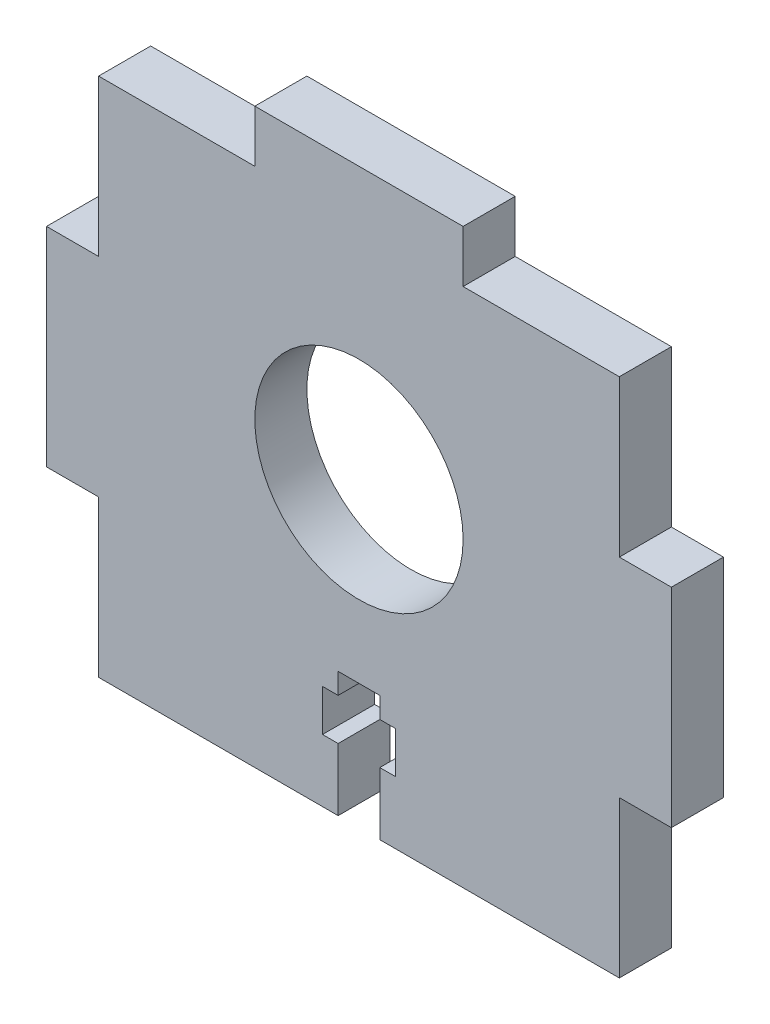
ISO-10303-21;
HEADER;
FILE_DESCRIPTION(('STEP AP214'),'2;1');
FILE_NAME('part.step','',(''),(''),'','','');
FILE_SCHEMA(('AUTOMOTIVE_DESIGN { 1 0 10303 214 1 1 1 1 }'));
ENDSEC;
DATA;
#1=APPLICATION_CONTEXT('core data for automotive mechanical design processes');
#2=APPLICATION_PROTOCOL_DEFINITION('international standard','automotive_design',2000,#1);
#3=PRODUCT_CONTEXT('',#1,'mechanical');
#4=PRODUCT('Part','Part','',(#3));
#5=PRODUCT_RELATED_PRODUCT_CATEGORY('part','',(#4));
#6=PRODUCT_DEFINITION_FORMATION('','',#4);
#7=PRODUCT_DEFINITION_CONTEXT('part definition',#1,'design');
#8=PRODUCT_DEFINITION('design','',#6,#7);
#9=PRODUCT_DEFINITION_SHAPE('','',#8);
#10=(LENGTH_UNIT() NAMED_UNIT(*) SI_UNIT(.MILLI.,.METRE.));
#11=(NAMED_UNIT(*) PLANE_ANGLE_UNIT() SI_UNIT($,.RADIAN.));
#12=(NAMED_UNIT(*) SI_UNIT($,.STERADIAN.) SOLID_ANGLE_UNIT());
#13=UNCERTAINTY_MEASURE_WITH_UNIT(LENGTH_MEASURE(1.E-05),#10,'distance_accuracy_value','');
#14=(GEOMETRIC_REPRESENTATION_CONTEXT(3) GLOBAL_UNCERTAINTY_ASSIGNED_CONTEXT((#13)) GLOBAL_UNIT_ASSIGNED_CONTEXT((#10,
#11,#12)) REPRESENTATION_CONTEXT('',''));
#15=CARTESIAN_POINT('',(0.,0.,0.));
#16=DIRECTION('',(0.,0.,1.));
#17=DIRECTION('',(1.,0.,0.));
#18=AXIS2_PLACEMENT_3D('',#15,#16,#17);
#19=CARTESIAN_POINT('',(-26.7512574518603,-20.1299853784487,5.));
#20=DIRECTION('',(0.,1.,0.));
#21=DIRECTION('',(0.,0.,1.));
#22=AXIS2_PLACEMENT_3D('',#19,#20,#21);
#23=PLANE('',#22);
#24=DIRECTION('',(1.,0.,0.));
#25=VECTOR('',#24,1.);
#26=CARTESIAN_POINT('',(-26.7512574518603,-20.1299853784487,0.));
#27=LINE('',#26,#25);
#28=CARTESIAN_POINT('',(-26.7512574518603,-20.1299853784487,0.));
#29=VERTEX_POINT('',#28);
#30=CARTESIAN_POINT('',(-3.75125745186031,-20.1299853784487,0.));
#31=VERTEX_POINT('',#30);
#32=EDGE_CURVE('E228',#29,#31,#27,.T.);
#33=ORIENTED_EDGE('',*,*,#32,.T.);
#34=DIRECTION('',(0.,0.,1.));
#35=VECTOR('',#34,1.);
#36=CARTESIAN_POINT('',(-3.75125745186031,-20.1299853784487,0.));
#37=LINE('',#36,#35);
#38=CARTESIAN_POINT('',(-3.75125745186031,-20.1299853784487,5.));
#39=VERTEX_POINT('',#38);
#40=EDGE_CURVE('E321',#31,#39,#37,.T.);
#41=ORIENTED_EDGE('',*,*,#40,.T.);
#42=DIRECTION('',(1.,0.,0.));
#43=VECTOR('',#42,1.);
#44=CARTESIAN_POINT('',(-26.7512574518603,-20.1299853784487,5.));
#45=LINE('',#44,#43);
#46=CARTESIAN_POINT('',(-26.7512574518603,-20.1299853784487,5.));
#47=VERTEX_POINT('',#46);
#48=EDGE_CURVE('E192',#47,#39,#45,.T.);
#49=ORIENTED_EDGE('',*,*,#48,.F.);
#50=DIRECTION('',(0.,0.,-1.));
#51=VECTOR('',#50,1.);
#52=CARTESIAN_POINT('',(-26.7512574518603,-20.1299853784487,5.));
#53=LINE('',#52,#51);
#54=EDGE_CURVE('E186',#47,#29,#53,.T.);
#55=ORIENTED_EDGE('',*,*,#54,.T.);
#56=EDGE_LOOP('',(#33,#41,#49,#55));
#57=FACE_BOUND('',#56,.T.);
#58=ADVANCED_FACE('F33',(#57),#23,.F.);
#59=CARTESIAN_POINT('',(23.2487425481397,-5.1299853784487,5.));
#60=DIRECTION('',(-1.,0.,0.));
#61=DIRECTION('',(0.,0.,1.));
#62=AXIS2_PLACEMENT_3D('',#59,#60,#61);
#63=PLANE('',#62);
#64=DIRECTION('',(0.,1.,0.));
#65=VECTOR('',#64,1.);
#66=CARTESIAN_POINT('',(23.2487425481397,-5.1299853784487,0.));
#67=LINE('',#66,#65);
#68=CARTESIAN_POINT('',(23.2487425481397,-20.1299853784487,0.));
#69=VERTEX_POINT('',#68);
#70=CARTESIAN_POINT('',(23.2487425481397,-5.1299853784487,0.));
#71=VERTEX_POINT('',#70);
#72=EDGE_CURVE('E197',#69,#71,#67,.T.);
#73=ORIENTED_EDGE('',*,*,#72,.T.);
#74=DIRECTION('',(0.,0.,-1.));
#75=VECTOR('',#74,1.);
#76=CARTESIAN_POINT('',(23.2487425481397,-5.1299853784487,5.));
#77=LINE('',#76,#75);
#78=CARTESIAN_POINT('',(23.2487425481397,-5.1299853784487,5.));
#79=VERTEX_POINT('',#78);
#80=EDGE_CURVE('E11',#79,#71,#77,.T.);
#81=ORIENTED_EDGE('',*,*,#80,.F.);
#82=DIRECTION('',(0.,1.,0.));
#83=VECTOR('',#82,1.);
#84=CARTESIAN_POINT('',(23.2487425481397,-5.1299853784487,5.));
#85=LINE('',#84,#83);
#86=CARTESIAN_POINT('',(23.2487425481397,-20.1299853784487,5.));
#87=VERTEX_POINT('',#86);
#88=EDGE_CURVE('E231',#87,#79,#85,.T.);
#89=ORIENTED_EDGE('',*,*,#88,.F.);
#90=DIRECTION('',(0.,0.,-1.));
#91=VECTOR('',#90,1.);
#92=CARTESIAN_POINT('',(23.2487425481397,-20.1299853784487,5.));
#93=LINE('',#92,#91);
#94=EDGE_CURVE('E196',#87,#69,#93,.T.);
#95=ORIENTED_EDGE('',*,*,#94,.T.);
#96=EDGE_LOOP('',(#73,#81,#89,#95));
#97=FACE_BOUND('',#96,.T.);
#98=ADVANCED_FACE('F35',(#97),#63,.F.);
#99=CARTESIAN_POINT('',(23.2487425481397,-5.1299853784487,5.));
#100=DIRECTION('',(0.,1.,0.));
#101=DIRECTION('',(-1.,0.,0.));
#102=AXIS2_PLACEMENT_3D('',#99,#100,#101);
#103=PLANE('',#102);
#104=DIRECTION('',(1.,0.,0.));
#105=VECTOR('',#104,1.);
#106=CARTESIAN_POINT('',(23.2487425481397,-5.1299853784487,0.));
#107=LINE('',#106,#105);
#108=CARTESIAN_POINT('',(28.2487425481397,-5.12998537844871,0.));
#109=VERTEX_POINT('',#108);
#110=EDGE_CURVE('E200',#71,#109,#107,.T.);
#111=ORIENTED_EDGE('',*,*,#110,.T.);
#112=DIRECTION('',(0.,0.,-1.));
#113=VECTOR('',#112,1.);
#114=CARTESIAN_POINT('',(28.2487425481397,-5.12998537844871,5.));
#115=LINE('',#114,#113);
#116=CARTESIAN_POINT('',(28.2487425481397,-5.12998537844871,5.));
#117=VERTEX_POINT('',#116);
#118=EDGE_CURVE('E41',#117,#109,#115,.T.);
#119=ORIENTED_EDGE('',*,*,#118,.F.);
#120=DIRECTION('',(1.,0.,0.));
#121=VECTOR('',#120,1.);
#122=CARTESIAN_POINT('',(23.2487425481397,-5.1299853784487,5.));
#123=LINE('',#122,#121);
#124=EDGE_CURVE('E123',#79,#117,#123,.T.);
#125=ORIENTED_EDGE('',*,*,#124,.F.);
#126=ORIENTED_EDGE('',*,*,#80,.T.);
#127=EDGE_LOOP('',(#111,#119,#125,#126));
#128=FACE_BOUND('',#127,.T.);
#129=ADVANCED_FACE('F488',(#128),#103,.F.);
#130=CARTESIAN_POINT('',(28.2487425481397,14.8700146215513,5.));
#131=DIRECTION('',(-1.,0.,0.));
#132=DIRECTION('',(0.,-1.,0.));
#133=AXIS2_PLACEMENT_3D('',#130,#131,#132);
#134=PLANE('',#133);
#135=DIRECTION('',(0.,1.,0.));
#136=VECTOR('',#135,1.);
#137=CARTESIAN_POINT('',(28.2487425481397,14.8700146215513,0.));
#138=LINE('',#137,#136);
#139=CARTESIAN_POINT('',(28.2487425481397,14.8700146215513,0.));
#140=VERTEX_POINT('',#139);
#141=EDGE_CURVE('E203',#109,#140,#138,.T.);
#142=ORIENTED_EDGE('',*,*,#141,.T.);
#143=DIRECTION('',(0.,0.,-1.));
#144=VECTOR('',#143,1.);
#145=CARTESIAN_POINT('',(28.2487425481397,14.8700146215513,5.));
#146=LINE('',#145,#144);
#147=CARTESIAN_POINT('',(28.2487425481397,14.8700146215513,5.));
#148=VERTEX_POINT('',#147);
#149=EDGE_CURVE('E262',#148,#140,#146,.T.);
#150=ORIENTED_EDGE('',*,*,#149,.F.);
#151=DIRECTION('',(0.,1.,0.));
#152=VECTOR('',#151,1.);
#153=CARTESIAN_POINT('',(28.2487425481397,14.8700146215513,5.));
#154=LINE('',#153,#152);
#155=EDGE_CURVE('E270',#117,#148,#154,.T.);
#156=ORIENTED_EDGE('',*,*,#155,.F.);
#157=ORIENTED_EDGE('',*,*,#118,.T.);
#158=EDGE_LOOP('',(#142,#150,#156,#157));
#159=FACE_BOUND('',#158,.T.);
#160=ADVANCED_FACE('F268',(#159),#134,.F.);
#161=CARTESIAN_POINT('',(23.2487425481397,14.8700146215513,5.));
#162=DIRECTION('',(0.,-1.,0.));
#163=DIRECTION('',(0.,0.,-1.));
#164=AXIS2_PLACEMENT_3D('',#161,#162,#163);
#165=PLANE('',#164);
#166=DIRECTION('',(-1.,0.,0.));
#167=VECTOR('',#166,1.);
#168=CARTESIAN_POINT('',(23.2487425481397,14.8700146215513,0.));
#169=LINE('',#168,#167);
#170=CARTESIAN_POINT('',(23.2487425481397,14.8700146215513,0.));
#171=VERTEX_POINT('',#170);
#172=EDGE_CURVE('E205',#140,#171,#169,.T.);
#173=ORIENTED_EDGE('',*,*,#172,.T.);
#174=DIRECTION('',(0.,0.,-1.));
#175=VECTOR('',#174,1.);
#176=CARTESIAN_POINT('',(23.2487425481397,14.8700146215513,5.));
#177=LINE('',#176,#175);
#178=CARTESIAN_POINT('',(23.2487425481397,14.8700146215513,5.));
#179=VERTEX_POINT('',#178);
#180=EDGE_CURVE('E259',#179,#171,#177,.T.);
#181=ORIENTED_EDGE('',*,*,#180,.F.);
#182=DIRECTION('',(-1.,0.,0.));
#183=VECTOR('',#182,1.);
#184=CARTESIAN_POINT('',(23.2487425481397,14.8700146215513,5.));
#185=LINE('',#184,#183);
#186=EDGE_CURVE('E289',#148,#179,#185,.T.);
#187=ORIENTED_EDGE('',*,*,#186,.F.);
#188=ORIENTED_EDGE('',*,*,#149,.T.);
#189=EDGE_LOOP('',(#173,#181,#187,#188));
#190=FACE_BOUND('',#189,.T.);
#191=ADVANCED_FACE('F280',(#190),#165,.F.);
#192=CARTESIAN_POINT('',(23.2487425481397,29.8700146215513,5.));
#193=DIRECTION('',(-1.,0.,0.));
#194=DIRECTION('',(0.,0.,1.));
#195=AXIS2_PLACEMENT_3D('',#192,#193,#194);
#196=PLANE('',#195);
#197=DIRECTION('',(0.,1.,0.));
#198=VECTOR('',#197,1.);
#199=CARTESIAN_POINT('',(23.2487425481397,29.8700146215513,0.));
#200=LINE('',#199,#198);
#201=CARTESIAN_POINT('',(23.2487425481397,29.8700146215513,0.));
#202=VERTEX_POINT('',#201);
#203=EDGE_CURVE('E207',#171,#202,#200,.T.);
#204=ORIENTED_EDGE('',*,*,#203,.T.);
#205=DIRECTION('',(0.,0.,-1.));
#206=VECTOR('',#205,1.);
#207=CARTESIAN_POINT('',(23.2487425481397,29.8700146215513,5.));
#208=LINE('',#207,#206);
#209=CARTESIAN_POINT('',(23.2487425481397,29.8700146215513,5.));
#210=VERTEX_POINT('',#209);
#211=EDGE_CURVE('E256',#210,#202,#208,.T.);
#212=ORIENTED_EDGE('',*,*,#211,.F.);
#213=DIRECTION('',(0.,1.,0.));
#214=VECTOR('',#213,1.);
#215=CARTESIAN_POINT('',(23.2487425481397,29.8700146215513,5.));
#216=LINE('',#215,#214);
#217=EDGE_CURVE('E286',#179,#210,#216,.T.);
#218=ORIENTED_EDGE('',*,*,#217,.F.);
#219=ORIENTED_EDGE('',*,*,#180,.T.);
#220=EDGE_LOOP('',(#204,#212,#218,#219));
#221=FACE_BOUND('',#220,.T.);
#222=ADVANCED_FACE('F284',(#221),#196,.F.);
#223=CARTESIAN_POINT('',(8.24874254813967,29.8700146215513,5.));
#224=DIRECTION('',(0.,-1.,0.));
#225=DIRECTION('',(1.,0.,0.));
#226=AXIS2_PLACEMENT_3D('',#223,#224,#225);
#227=PLANE('',#226);
#228=DIRECTION('',(-1.,0.,0.));
#229=VECTOR('',#228,1.);
#230=CARTESIAN_POINT('',(8.24874254813967,29.8700146215513,0.));
#231=LINE('',#230,#229);
#232=CARTESIAN_POINT('',(8.24874254813967,29.8700146215513,0.));
#233=VERTEX_POINT('',#232);
#234=EDGE_CURVE('E209',#202,#233,#231,.T.);
#235=ORIENTED_EDGE('',*,*,#234,.T.);
#236=DIRECTION('',(0.,0.,-1.));
#237=VECTOR('',#236,1.);
#238=CARTESIAN_POINT('',(8.24874254813967,29.8700146215513,5.));
#239=LINE('',#238,#237);
#240=CARTESIAN_POINT('',(8.24874254813967,29.8700146215513,5.));
#241=VERTEX_POINT('',#240);
#242=EDGE_CURVE('E253',#241,#233,#239,.T.);
#243=ORIENTED_EDGE('',*,*,#242,.F.);
#244=DIRECTION('',(-1.,0.,0.));
#245=VECTOR('',#244,1.);
#246=CARTESIAN_POINT('',(8.24874254813967,29.8700146215513,5.));
#247=LINE('',#246,#245);
#248=EDGE_CURVE('E288',#210,#241,#247,.T.);
#249=ORIENTED_EDGE('',*,*,#248,.F.);
#250=ORIENTED_EDGE('',*,*,#211,.T.);
#251=EDGE_LOOP('',(#235,#243,#249,#250));
#252=FACE_BOUND('',#251,.T.);
#253=ADVANCED_FACE('F729',(#252),#227,.F.);
#254=CARTESIAN_POINT('',(8.24874254813967,29.8700146215513,5.));
#255=DIRECTION('',(-1.,0.,0.));
#256=DIRECTION('',(0.,0.,1.));
#257=AXIS2_PLACEMENT_3D('',#254,#255,#256);
#258=PLANE('',#257);
#259=DIRECTION('',(0.,1.,0.));
#260=VECTOR('',#259,1.);
#261=CARTESIAN_POINT('',(8.24874254813967,29.8700146215513,0.));
#262=LINE('',#261,#260);
#263=CARTESIAN_POINT('',(8.24874254813967,34.8700146215513,0.));
#264=VERTEX_POINT('',#263);
#265=EDGE_CURVE('E211',#233,#264,#262,.T.);
#266=ORIENTED_EDGE('',*,*,#265,.T.);
#267=DIRECTION('',(0.,0.,-1.));
#268=VECTOR('',#267,1.);
#269=CARTESIAN_POINT('',(8.24874254813967,34.8700146215513,5.));
#270=LINE('',#269,#268);
#271=CARTESIAN_POINT('',(8.24874254813967,34.8700146215513,5.));
#272=VERTEX_POINT('',#271);
#273=EDGE_CURVE('E250',#272,#264,#270,.T.);
#274=ORIENTED_EDGE('',*,*,#273,.F.);
#275=DIRECTION('',(0.,1.,0.));
#276=VECTOR('',#275,1.);
#277=CARTESIAN_POINT('',(8.24874254813967,29.8700146215513,5.));
#278=LINE('',#277,#276);
#279=EDGE_CURVE('E291',#241,#272,#278,.T.);
#280=ORIENTED_EDGE('',*,*,#279,.F.);
#281=ORIENTED_EDGE('',*,*,#242,.T.);
#282=EDGE_LOOP('',(#266,#274,#280,#281));
#283=FACE_BOUND('',#282,.T.);
#284=ADVANCED_FACE('F720',(#283),#258,.F.);
#285=CARTESIAN_POINT('',(-11.7512574518603,34.8700146215513,5.));
#286=DIRECTION('',(0.,-1.,0.));
#287=DIRECTION('',(0.,0.,-1.));
#288=AXIS2_PLACEMENT_3D('',#285,#286,#287);
#289=PLANE('',#288);
#290=DIRECTION('',(-1.,0.,0.));
#291=VECTOR('',#290,1.);
#292=CARTESIAN_POINT('',(-11.7512574518603,34.8700146215513,0.));
#293=LINE('',#292,#291);
#294=CARTESIAN_POINT('',(-11.7512574518603,34.8700146215513,0.));
#295=VERTEX_POINT('',#294);
#296=EDGE_CURVE('E213',#264,#295,#293,.T.);
#297=ORIENTED_EDGE('',*,*,#296,.T.);
#298=DIRECTION('',(0.,0.,-1.));
#299=VECTOR('',#298,1.);
#300=CARTESIAN_POINT('',(-11.7512574518603,34.8700146215513,5.));
#301=LINE('',#300,#299);
#302=CARTESIAN_POINT('',(-11.7512574518603,34.8700146215513,5.));
#303=VERTEX_POINT('',#302);
#304=EDGE_CURVE('E247',#303,#295,#301,.T.);
#305=ORIENTED_EDGE('',*,*,#304,.F.);
#306=DIRECTION('',(-1.,0.,0.));
#307=VECTOR('',#306,1.);
#308=CARTESIAN_POINT('',(-11.7512574518603,34.8700146215513,5.));
#309=LINE('',#308,#307);
#310=EDGE_CURVE('E297',#272,#303,#309,.T.);
#311=ORIENTED_EDGE('',*,*,#310,.F.);
#312=ORIENTED_EDGE('',*,*,#273,.T.);
#313=EDGE_LOOP('',(#297,#305,#311,#312));
#314=FACE_BOUND('',#313,.T.);
#315=ADVANCED_FACE('F711',(#314),#289,.F.);
#316=CARTESIAN_POINT('',(-11.7512574518603,29.8700146215513,5.));
#317=DIRECTION('',(1.,0.,0.));
#318=DIRECTION('',(0.,0.,-1.));
#319=AXIS2_PLACEMENT_3D('',#316,#317,#318);
#320=PLANE('',#319);
#321=DIRECTION('',(0.,-1.,0.));
#322=VECTOR('',#321,1.);
#323=CARTESIAN_POINT('',(-11.7512574518603,29.8700146215513,0.));
#324=LINE('',#323,#322);
#325=CARTESIAN_POINT('',(-11.7512574518603,29.8700146215513,0.));
#326=VERTEX_POINT('',#325);
#327=EDGE_CURVE('E215',#295,#326,#324,.T.);
#328=ORIENTED_EDGE('',*,*,#327,.T.);
#329=DIRECTION('',(0.,0.,-1.));
#330=VECTOR('',#329,1.);
#331=CARTESIAN_POINT('',(-11.7512574518603,29.8700146215513,5.));
#332=LINE('',#331,#330);
#333=CARTESIAN_POINT('',(-11.7512574518603,29.8700146215513,5.));
#334=VERTEX_POINT('',#333);
#335=EDGE_CURVE('E244',#334,#326,#332,.T.);
#336=ORIENTED_EDGE('',*,*,#335,.F.);
#337=DIRECTION('',(0.,-1.,0.));
#338=VECTOR('',#337,1.);
#339=CARTESIAN_POINT('',(-11.7512574518603,29.8700146215513,5.));
#340=LINE('',#339,#338);
#341=EDGE_CURVE('E299',#303,#334,#340,.T.);
#342=ORIENTED_EDGE('',*,*,#341,.F.);
#343=ORIENTED_EDGE('',*,*,#304,.T.);
#344=EDGE_LOOP('',(#328,#336,#342,#343));
#345=FACE_BOUND('',#344,.T.);
#346=ADVANCED_FACE('F702',(#345),#320,.F.);
#347=CARTESIAN_POINT('',(-26.7512574518603,29.8700146215513,5.));
#348=DIRECTION('',(0.,-1.,0.));
#349=DIRECTION('',(1.,0.,0.));
#350=AXIS2_PLACEMENT_3D('',#347,#348,#349);
#351=PLANE('',#350);
#352=DIRECTION('',(-1.,0.,0.));
#353=VECTOR('',#352,1.);
#354=CARTESIAN_POINT('',(-26.7512574518603,29.8700146215513,0.));
#355=LINE('',#354,#353);
#356=CARTESIAN_POINT('',(-26.7512574518603,29.8700146215513,0.));
#357=VERTEX_POINT('',#356);
#358=EDGE_CURVE('E217',#326,#357,#355,.T.);
#359=ORIENTED_EDGE('',*,*,#358,.T.);
#360=DIRECTION('',(0.,0.,-1.));
#361=VECTOR('',#360,1.);
#362=CARTESIAN_POINT('',(-26.7512574518603,29.8700146215513,5.));
#363=LINE('',#362,#361);
#364=CARTESIAN_POINT('',(-26.7512574518603,29.8700146215513,5.));
#365=VERTEX_POINT('',#364);
#366=EDGE_CURVE('E241',#365,#357,#363,.T.);
#367=ORIENTED_EDGE('',*,*,#366,.F.);
#368=DIRECTION('',(-1.,0.,0.));
#369=VECTOR('',#368,1.);
#370=CARTESIAN_POINT('',(-26.7512574518603,29.8700146215513,5.));
#371=LINE('',#370,#369);
#372=EDGE_CURVE('E301',#334,#365,#371,.T.);
#373=ORIENTED_EDGE('',*,*,#372,.F.);
#374=ORIENTED_EDGE('',*,*,#335,.T.);
#375=EDGE_LOOP('',(#359,#367,#373,#374));
#376=FACE_BOUND('',#375,.T.);
#377=ADVANCED_FACE('F693',(#376),#351,.F.);
#378=CARTESIAN_POINT('',(-26.7512574518603,29.8700146215513,5.));
#379=DIRECTION('',(1.,0.,0.));
#380=DIRECTION('',(0.,0.,-1.));
#381=AXIS2_PLACEMENT_3D('',#378,#379,#380);
#382=PLANE('',#381);
#383=DIRECTION('',(0.,-1.,0.));
#384=VECTOR('',#383,1.);
#385=CARTESIAN_POINT('',(-26.7512574518603,29.8700146215513,0.));
#386=LINE('',#385,#384);
#387=CARTESIAN_POINT('',(-26.7512574518603,14.8700146215513,0.));
#388=VERTEX_POINT('',#387);
#389=EDGE_CURVE('E219',#357,#388,#386,.T.);
#390=ORIENTED_EDGE('',*,*,#389,.T.);
#391=DIRECTION('',(0.,0.,-1.));
#392=VECTOR('',#391,1.);
#393=CARTESIAN_POINT('',(-26.7512574518603,14.8700146215513,5.));
#394=LINE('',#393,#392);
#395=CARTESIAN_POINT('',(-26.7512574518603,14.8700146215513,5.));
#396=VERTEX_POINT('',#395);
#397=EDGE_CURVE('E238',#396,#388,#394,.T.);
#398=ORIENTED_EDGE('',*,*,#397,.F.);
#399=DIRECTION('',(0.,-1.,0.));
#400=VECTOR('',#399,1.);
#401=CARTESIAN_POINT('',(-26.7512574518603,29.8700146215513,5.));
#402=LINE('',#401,#400);
#403=EDGE_CURVE('E303',#365,#396,#402,.T.);
#404=ORIENTED_EDGE('',*,*,#403,.F.);
#405=ORIENTED_EDGE('',*,*,#366,.T.);
#406=EDGE_LOOP('',(#390,#398,#404,#405));
#407=FACE_BOUND('',#406,.T.);
#408=ADVANCED_FACE('F685',(#407),#382,.F.);
#409=CARTESIAN_POINT('',(-26.7512574518603,14.8700146215513,5.));
#410=DIRECTION('',(0.,-1.,0.));
#411=DIRECTION('',(0.,0.,-1.));
#412=AXIS2_PLACEMENT_3D('',#409,#410,#411);
#413=PLANE('',#412);
#414=DIRECTION('',(-1.,0.,0.));
#415=VECTOR('',#414,1.);
#416=CARTESIAN_POINT('',(-26.7512574518603,14.8700146215513,0.));
#417=LINE('',#416,#415);
#418=CARTESIAN_POINT('',(-31.7512574518603,14.8700146215513,0.));
#419=VERTEX_POINT('',#418);
#420=EDGE_CURVE('E221',#388,#419,#417,.T.);
#421=ORIENTED_EDGE('',*,*,#420,.T.);
#422=DIRECTION('',(0.,0.,-1.));
#423=VECTOR('',#422,1.);
#424=CARTESIAN_POINT('',(-31.7512574518603,14.8700146215513,5.));
#425=LINE('',#424,#423);
#426=CARTESIAN_POINT('',(-31.7512574518603,14.8700146215513,5.));
#427=VERTEX_POINT('',#426);
#428=EDGE_CURVE('E235',#427,#419,#425,.T.);
#429=ORIENTED_EDGE('',*,*,#428,.F.);
#430=DIRECTION('',(-1.,0.,0.));
#431=VECTOR('',#430,1.);
#432=CARTESIAN_POINT('',(-26.7512574518603,14.8700146215513,5.));
#433=LINE('',#432,#431);
#434=EDGE_CURVE('E305',#396,#427,#433,.T.);
#435=ORIENTED_EDGE('',*,*,#434,.F.);
#436=ORIENTED_EDGE('',*,*,#397,.T.);
#437=EDGE_LOOP('',(#421,#429,#435,#436));
#438=FACE_BOUND('',#437,.T.);
#439=ADVANCED_FACE('F311',(#438),#413,.F.);
#440=CARTESIAN_POINT('',(-31.7512574518603,-5.12998537844872,5.));
#441=DIRECTION('',(1.,0.,0.));
#442=DIRECTION('',(0.,0.,-1.));
#443=AXIS2_PLACEMENT_3D('',#440,#441,#442);
#444=PLANE('',#443);
#445=DIRECTION('',(0.,-1.,0.));
#446=VECTOR('',#445,1.);
#447=CARTESIAN_POINT('',(-31.7512574518603,-5.12998537844872,0.));
#448=LINE('',#447,#446);
#449=CARTESIAN_POINT('',(-31.7512574518603,-5.12998537844872,0.));
#450=VERTEX_POINT('',#449);
#451=EDGE_CURVE('E223',#419,#450,#448,.T.);
#452=ORIENTED_EDGE('',*,*,#451,.T.);
#453=DIRECTION('',(0.,0.,-1.));
#454=VECTOR('',#453,1.);
#455=CARTESIAN_POINT('',(-31.7512574518603,-5.12998537844872,5.));
#456=LINE('',#455,#454);
#457=CARTESIAN_POINT('',(-31.7512574518603,-5.12998537844872,5.));
#458=VERTEX_POINT('',#457);
#459=EDGE_CURVE('E185',#458,#450,#456,.T.);
#460=ORIENTED_EDGE('',*,*,#459,.F.);
#461=DIRECTION('',(0.,-1.,0.));
#462=VECTOR('',#461,1.);
#463=CARTESIAN_POINT('',(-31.7512574518603,-5.12998537844872,5.));
#464=LINE('',#463,#462);
#465=EDGE_CURVE('E173',#427,#458,#464,.T.);
#466=ORIENTED_EDGE('',*,*,#465,.F.);
#467=ORIENTED_EDGE('',*,*,#428,.T.);
#468=EDGE_LOOP('',(#452,#460,#466,#467));
#469=FACE_BOUND('',#468,.T.);
#470=ADVANCED_FACE('F315',(#469),#444,.F.);
#471=CARTESIAN_POINT('',(-26.7512574518603,-5.12998537844872,5.));
#472=DIRECTION('',(0.,1.,0.));
#473=DIRECTION('',(0.,0.,1.));
#474=AXIS2_PLACEMENT_3D('',#471,#472,#473);
#475=PLANE('',#474);
#476=DIRECTION('',(1.,0.,0.));
#477=VECTOR('',#476,1.);
#478=CARTESIAN_POINT('',(-26.7512574518603,-5.12998537844872,0.));
#479=LINE('',#478,#477);
#480=CARTESIAN_POINT('',(-26.7512574518603,-5.12998537844872,0.));
#481=VERTEX_POINT('',#480);
#482=EDGE_CURVE('E182',#450,#481,#479,.T.);
#483=ORIENTED_EDGE('',*,*,#482,.T.);
#484=DIRECTION('',(0.,0.,-1.));
#485=VECTOR('',#484,1.);
#486=CARTESIAN_POINT('',(-26.7512574518603,-5.12998537844872,5.));
#487=LINE('',#486,#485);
#488=CARTESIAN_POINT('',(-26.7512574518603,-5.12998537844872,5.));
#489=VERTEX_POINT('',#488);
#490=EDGE_CURVE('E179',#489,#481,#487,.T.);
#491=ORIENTED_EDGE('',*,*,#490,.F.);
#492=DIRECTION('',(1.,0.,0.));
#493=VECTOR('',#492,1.);
#494=CARTESIAN_POINT('',(-26.7512574518603,-5.12998537844872,5.));
#495=LINE('',#494,#493);
#496=EDGE_CURVE('E163',#458,#489,#495,.T.);
#497=ORIENTED_EDGE('',*,*,#496,.F.);
#498=ORIENTED_EDGE('',*,*,#459,.T.);
#499=EDGE_LOOP('',(#483,#491,#497,#498));
#500=FACE_BOUND('',#499,.T.);
#501=ADVANCED_FACE('F180',(#500),#475,.F.);
#502=CARTESIAN_POINT('',(-26.7512574518603,-5.12998537844872,5.));
#503=DIRECTION('',(1.,0.,0.));
#504=DIRECTION('',(0.,0.,-1.));
#505=AXIS2_PLACEMENT_3D('',#502,#503,#504);
#506=PLANE('',#505);
#507=DIRECTION('',(0.,-1.,0.));
#508=VECTOR('',#507,1.);
#509=CARTESIAN_POINT('',(-26.7512574518603,-5.12998537844872,0.));
#510=LINE('',#509,#508);
#511=EDGE_CURVE('E226',#481,#29,#510,.T.);
#512=ORIENTED_EDGE('',*,*,#511,.T.);
#513=ORIENTED_EDGE('',*,*,#54,.F.);
#514=DIRECTION('',(0.,-1.,0.));
#515=VECTOR('',#514,1.);
#516=CARTESIAN_POINT('',(-26.7512574518603,-5.12998537844872,5.));
#517=LINE('',#516,#515);
#518=EDGE_CURVE('E170',#489,#47,#517,.T.);
#519=ORIENTED_EDGE('',*,*,#518,.F.);
#520=ORIENTED_EDGE('',*,*,#490,.T.);
#521=EDGE_LOOP('',(#512,#513,#519,#520));
#522=FACE_BOUND('',#521,.T.);
#523=ADVANCED_FACE('F188',(#522),#506,.F.);
#524=CARTESIAN_POINT('',(0.248742548139686,-20.1299853784487,5.));
#525=VERTEX_POINT('',#524);
#526=EDGE_CURVE('E57',#525,#87,#45,.T.);
#527=ORIENTED_EDGE('',*,*,#526,.F.);
#528=DIRECTION('',(0.,0.,1.));
#529=VECTOR('',#528,1.);
#530=CARTESIAN_POINT('',(0.248742548139686,-20.1299853784487,0.));
#531=LINE('',#530,#529);
#532=CARTESIAN_POINT('',(0.248742548139686,-20.1299853784487,0.));
#533=VERTEX_POINT('',#532);
#534=EDGE_CURVE('E434',#533,#525,#531,.T.);
#535=ORIENTED_EDGE('',*,*,#534,.F.);
#536=EDGE_CURVE('E115',#533,#69,#27,.T.);
#537=ORIENTED_EDGE('',*,*,#536,.T.);
#538=ORIENTED_EDGE('',*,*,#94,.F.);
#539=EDGE_LOOP('',(#527,#535,#537,#538));
#540=FACE_BOUND('',#539,.T.);
#541=ADVANCED_FACE('F497',(#540),#23,.F.);
#542=CARTESIAN_POINT('',(0.,0.,5.));
#543=DIRECTION('',(0.,0.,1.));
#544=DIRECTION('',(1.,0.,0.));
#545=AXIS2_PLACEMENT_3D('',#542,#543,#544);
#546=PLANE('',#545);
#547=DIRECTION('',(0.,-1.,0.));
#548=VECTOR('',#547,1.);
#549=CARTESIAN_POINT('',(-3.75125745186031,-20.1299853784487,5.));
#550=LINE('',#549,#548);
#551=CARTESIAN_POINT('',(-3.75125745186031,-14.1299853784487,5.));
#552=VERTEX_POINT('',#551);
#553=EDGE_CURVE('E325',#552,#39,#550,.T.);
#554=ORIENTED_EDGE('',*,*,#553,.F.);
#555=DIRECTION('',(1.,0.,0.));
#556=VECTOR('',#555,1.);
#557=CARTESIAN_POINT('',(-3.75125745186031,-14.1299853784487,5.));
#558=LINE('',#557,#556);
#559=CARTESIAN_POINT('',(-5.25125745186031,-14.1299853784487,5.));
#560=VERTEX_POINT('',#559);
#561=EDGE_CURVE('E459',#560,#552,#558,.T.);
#562=ORIENTED_EDGE('',*,*,#561,.F.);
#563=DIRECTION('',(0.,-1.,0.));
#564=VECTOR('',#563,1.);
#565=CARTESIAN_POINT('',(-5.25125745186031,-14.1299853784487,5.));
#566=LINE('',#565,#564);
#567=CARTESIAN_POINT('',(-5.25125745186031,-10.1299853784487,5.));
#568=VERTEX_POINT('',#567);
#569=EDGE_CURVE('E456',#568,#560,#566,.T.);
#570=ORIENTED_EDGE('',*,*,#569,.F.);
#571=DIRECTION('',(-1.,0.,0.));
#572=VECTOR('',#571,1.);
#573=CARTESIAN_POINT('',(-5.25125745186031,-10.1299853784487,5.));
#574=LINE('',#573,#572);
#575=CARTESIAN_POINT('',(-3.75125745186031,-10.1299853784487,5.));
#576=VERTEX_POINT('',#575);
#577=EDGE_CURVE('E453',#576,#568,#574,.T.);
#578=ORIENTED_EDGE('',*,*,#577,.F.);
#579=DIRECTION('',(0.,-1.,0.));
#580=VECTOR('',#579,1.);
#581=CARTESIAN_POINT('',(-3.75125745186031,-10.1299853784487,5.));
#582=LINE('',#581,#580);
#583=CARTESIAN_POINT('',(-3.75125745186031,-8.12998537844871,5.));
#584=VERTEX_POINT('',#583);
#585=EDGE_CURVE('E450',#584,#576,#582,.T.);
#586=ORIENTED_EDGE('',*,*,#585,.F.);
#587=DIRECTION('',(-1.,0.,0.));
#588=VECTOR('',#587,1.);
#589=CARTESIAN_POINT('',(-3.75125745186031,-8.12998537844871,5.));
#590=LINE('',#589,#588);
#591=CARTESIAN_POINT('',(0.248742548139684,-8.12998537844871,5.));
#592=VERTEX_POINT('',#591);
#593=EDGE_CURVE('E447',#592,#584,#590,.T.);
#594=ORIENTED_EDGE('',*,*,#593,.F.);
#595=DIRECTION('',(0.,1.,0.));
#596=VECTOR('',#595,1.);
#597=CARTESIAN_POINT('',(0.248742548139684,-8.12998537844871,5.));
#598=LINE('',#597,#596);
#599=CARTESIAN_POINT('',(0.248742548139684,-10.1299853784487,5.));
#600=VERTEX_POINT('',#599);
#601=EDGE_CURVE('E444',#600,#592,#598,.T.);
#602=ORIENTED_EDGE('',*,*,#601,.F.);
#603=DIRECTION('',(-1.,0.,0.));
#604=VECTOR('',#603,1.);
#605=CARTESIAN_POINT('',(0.248742548139684,-10.1299853784487,5.));
#606=LINE('',#605,#604);
#607=CARTESIAN_POINT('',(1.74874254813968,-10.1299853784487,5.));
#608=VERTEX_POINT('',#607);
#609=EDGE_CURVE('E441',#608,#600,#606,.T.);
#610=ORIENTED_EDGE('',*,*,#609,.F.);
#611=DIRECTION('',(0.,1.,0.));
#612=VECTOR('',#611,1.);
#613=CARTESIAN_POINT('',(1.74874254813968,-10.1299853784487,5.));
#614=LINE('',#613,#612);
#615=CARTESIAN_POINT('',(1.74874254813968,-14.1299853784487,5.));
#616=VERTEX_POINT('',#615);
#617=EDGE_CURVE('E439',#616,#608,#614,.T.);
#618=ORIENTED_EDGE('',*,*,#617,.F.);
#619=DIRECTION('',(1.,0.,0.));
#620=VECTOR('',#619,1.);
#621=CARTESIAN_POINT('',(1.74874254813968,-14.1299853784487,5.));
#622=LINE('',#621,#620);
#623=CARTESIAN_POINT('',(0.248742548139685,-14.1299853784487,5.));
#624=VERTEX_POINT('',#623);
#625=EDGE_CURVE('E395',#624,#616,#622,.T.);
#626=ORIENTED_EDGE('',*,*,#625,.F.);
#627=DIRECTION('',(0.,1.,0.));
#628=VECTOR('',#627,1.);
#629=CARTESIAN_POINT('',(0.248742548139685,-14.1299853784487,5.));
#630=LINE('',#629,#628);
#631=EDGE_CURVE('E435',#525,#624,#630,.T.);
#632=ORIENTED_EDGE('',*,*,#631,.F.);
#633=ORIENTED_EDGE('',*,*,#526,.T.);
#634=ORIENTED_EDGE('',*,*,#88,.T.);
#635=ORIENTED_EDGE('',*,*,#124,.T.);
#636=ORIENTED_EDGE('',*,*,#155,.T.);
#637=ORIENTED_EDGE('',*,*,#186,.T.);
#638=ORIENTED_EDGE('',*,*,#217,.T.);
#639=ORIENTED_EDGE('',*,*,#248,.T.);
#640=ORIENTED_EDGE('',*,*,#279,.T.);
#641=ORIENTED_EDGE('',*,*,#310,.T.);
#642=ORIENTED_EDGE('',*,*,#341,.T.);
#643=ORIENTED_EDGE('',*,*,#372,.T.);
#644=ORIENTED_EDGE('',*,*,#403,.T.);
#645=ORIENTED_EDGE('',*,*,#434,.T.);
#646=ORIENTED_EDGE('',*,*,#465,.T.);
#647=ORIENTED_EDGE('',*,*,#496,.T.);
#648=ORIENTED_EDGE('',*,*,#518,.T.);
#649=ORIENTED_EDGE('',*,*,#48,.T.);
#650=EDGE_LOOP('',(#554,#562,#570,#578,#586,#594,#602,#610,#618,#626,#632,#633,#634,#635,#636,
#637,#638,#639,#640,#641,#642,#643,#644,#645,#646,#647,#648,#649));
#651=FACE_BOUND('',#650,.T.);
#652=CARTESIAN_POINT('',(-1.75125745186032,8.82797243636973,5.));
#653=DIRECTION('',(0.,0.,1.));
#654=DIRECTION('',(1.,0.,0.));
#655=AXIS2_PLACEMENT_3D('',#652,#653,#654);
#656=CIRCLE('',#655,10.);
#657=CARTESIAN_POINT('',(8.24874254813969,8.82797243636973,5.));
#658=VERTEX_POINT('',#657);
#659=EDGE_CURVE('E463',#658,#658,#656,.T.);
#660=ORIENTED_EDGE('',*,*,#659,.F.);
#661=EDGE_LOOP('',(#660));
#662=FACE_BOUND('',#661,.T.);
#663=ADVANCED_FACE('F166',(#651,#662),#546,.T.);
#664=CARTESIAN_POINT('',(0.,0.,0.));
#665=DIRECTION('',(0.,0.,1.));
#666=DIRECTION('',(1.,0.,0.));
#667=AXIS2_PLACEMENT_3D('',#664,#665,#666);
#668=PLANE('',#667);
#669=CARTESIAN_POINT('',(-1.75125745186032,8.82797243636973,0.));
#670=DIRECTION('',(0.,0.,1.));
#671=DIRECTION('',(1.,0.,0.));
#672=AXIS2_PLACEMENT_3D('',#669,#670,#671);
#673=CIRCLE('',#672,10.);
#674=CARTESIAN_POINT('',(8.24874254813969,8.82797243636973,0.));
#675=VERTEX_POINT('',#674);
#676=EDGE_CURVE('E201',#675,#675,#673,.T.);
#677=ORIENTED_EDGE('',*,*,#676,.T.);
#678=EDGE_LOOP('',(#677));
#679=FACE_BOUND('',#678,.T.);
#680=DIRECTION('',(1.,0.,0.));
#681=VECTOR('',#680,1.);
#682=CARTESIAN_POINT('',(-3.75125745186031,-14.1299853784487,0.));
#683=LINE('',#682,#681);
#684=CARTESIAN_POINT('',(-5.25125745186031,-14.1299853784487,0.));
#685=VERTEX_POINT('',#684);
#686=CARTESIAN_POINT('',(-3.75125745186031,-14.1299853784487,0.));
#687=VERTEX_POINT('',#686);
#688=EDGE_CURVE('E430',#685,#687,#683,.T.);
#689=ORIENTED_EDGE('',*,*,#688,.T.);
#690=DIRECTION('',(0.,-1.,0.));
#691=VECTOR('',#690,1.);
#692=CARTESIAN_POINT('',(-3.75125745186031,-20.1299853784487,0.));
#693=LINE('',#692,#691);
#694=EDGE_CURVE('E432',#687,#31,#693,.T.);
#695=ORIENTED_EDGE('',*,*,#694,.T.);
#696=ORIENTED_EDGE('',*,*,#32,.F.);
#697=ORIENTED_EDGE('',*,*,#511,.F.);
#698=ORIENTED_EDGE('',*,*,#482,.F.);
#699=ORIENTED_EDGE('',*,*,#451,.F.);
#700=ORIENTED_EDGE('',*,*,#420,.F.);
#701=ORIENTED_EDGE('',*,*,#389,.F.);
#702=ORIENTED_EDGE('',*,*,#358,.F.);
#703=ORIENTED_EDGE('',*,*,#327,.F.);
#704=ORIENTED_EDGE('',*,*,#296,.F.);
#705=ORIENTED_EDGE('',*,*,#265,.F.);
#706=ORIENTED_EDGE('',*,*,#234,.F.);
#707=ORIENTED_EDGE('',*,*,#203,.F.);
#708=ORIENTED_EDGE('',*,*,#172,.F.);
#709=ORIENTED_EDGE('',*,*,#141,.F.);
#710=ORIENTED_EDGE('',*,*,#110,.F.);
#711=ORIENTED_EDGE('',*,*,#72,.F.);
#712=ORIENTED_EDGE('',*,*,#536,.F.);
#713=DIRECTION('',(0.,1.,0.));
#714=VECTOR('',#713,1.);
#715=CARTESIAN_POINT('',(0.248742548139685,-14.1299853784487,0.));
#716=LINE('',#715,#714);
#717=CARTESIAN_POINT('',(0.248742548139685,-14.1299853784487,0.));
#718=VERTEX_POINT('',#717);
#719=EDGE_CURVE('E410',#533,#718,#716,.T.);
#720=ORIENTED_EDGE('',*,*,#719,.T.);
#721=DIRECTION('',(1.,0.,0.));
#722=VECTOR('',#721,1.);
#723=CARTESIAN_POINT('',(1.74874254813968,-14.1299853784487,0.));
#724=LINE('',#723,#722);
#725=CARTESIAN_POINT('',(1.74874254813968,-14.1299853784487,0.));
#726=VERTEX_POINT('',#725);
#727=EDGE_CURVE('E48',#718,#726,#724,.T.);
#728=ORIENTED_EDGE('',*,*,#727,.T.);
#729=DIRECTION('',(0.,1.,0.));
#730=VECTOR('',#729,1.);
#731=CARTESIAN_POINT('',(1.74874254813968,-10.1299853784487,0.));
#732=LINE('',#731,#730);
#733=CARTESIAN_POINT('',(1.74874254813968,-10.1299853784487,0.));
#734=VERTEX_POINT('',#733);
#735=EDGE_CURVE('E403',#726,#734,#732,.T.);
#736=ORIENTED_EDGE('',*,*,#735,.T.);
#737=DIRECTION('',(-1.,0.,0.));
#738=VECTOR('',#737,1.);
#739=CARTESIAN_POINT('',(0.248742548139684,-10.1299853784487,0.));
#740=LINE('',#739,#738);
#741=CARTESIAN_POINT('',(0.248742548139684,-10.1299853784487,0.));
#742=VERTEX_POINT('',#741);
#743=EDGE_CURVE('E407',#734,#742,#740,.T.);
#744=ORIENTED_EDGE('',*,*,#743,.T.);
#745=DIRECTION('',(0.,1.,0.));
#746=VECTOR('',#745,1.);
#747=CARTESIAN_POINT('',(0.248742548139684,-8.12998537844871,0.));
#748=LINE('',#747,#746);
#749=CARTESIAN_POINT('',(0.248742548139684,-8.12998537844871,0.));
#750=VERTEX_POINT('',#749);
#751=EDGE_CURVE('E415',#742,#750,#748,.T.);
#752=ORIENTED_EDGE('',*,*,#751,.T.);
#753=DIRECTION('',(-1.,0.,0.));
#754=VECTOR('',#753,1.);
#755=CARTESIAN_POINT('',(-3.75125745186031,-8.12998537844871,0.));
#756=LINE('',#755,#754);
#757=CARTESIAN_POINT('',(-3.75125745186031,-8.12998537844871,0.));
#758=VERTEX_POINT('',#757);
#759=EDGE_CURVE('E418',#750,#758,#756,.T.);
#760=ORIENTED_EDGE('',*,*,#759,.T.);
#761=DIRECTION('',(0.,-1.,0.));
#762=VECTOR('',#761,1.);
#763=CARTESIAN_POINT('',(-3.75125745186031,-10.1299853784487,0.));
#764=LINE('',#763,#762);
#765=CARTESIAN_POINT('',(-3.75125745186031,-10.1299853784487,0.));
#766=VERTEX_POINT('',#765);
#767=EDGE_CURVE('E421',#758,#766,#764,.T.);
#768=ORIENTED_EDGE('',*,*,#767,.T.);
#769=DIRECTION('',(-1.,0.,0.));
#770=VECTOR('',#769,1.);
#771=CARTESIAN_POINT('',(-5.25125745186031,-10.1299853784487,0.));
#772=LINE('',#771,#770);
#773=CARTESIAN_POINT('',(-5.25125745186031,-10.1299853784487,0.));
#774=VERTEX_POINT('',#773);
#775=EDGE_CURVE('E424',#766,#774,#772,.T.);
#776=ORIENTED_EDGE('',*,*,#775,.T.);
#777=DIRECTION('',(0.,-1.,0.));
#778=VECTOR('',#777,1.);
#779=CARTESIAN_POINT('',(-5.25125745186031,-14.1299853784487,0.));
#780=LINE('',#779,#778);
#781=EDGE_CURVE('E427',#774,#685,#780,.T.);
#782=ORIENTED_EDGE('',*,*,#781,.T.);
#783=EDGE_LOOP('',(#689,#695,#696,#697,#698,#699,#700,#701,#702,#703,#704,#705,#706,#707,#708,
#709,#710,#711,#712,#720,#728,#736,#744,#752,#760,#768,#776,#782));
#784=FACE_BOUND('',#783,.T.);
#785=ADVANCED_FACE('F274',(#679,#784),#668,.F.);
#786=CARTESIAN_POINT('',(-1.75125745186032,8.82797243636973,0.));
#787=DIRECTION('',(0.,0.,1.));
#788=DIRECTION('',(1.,0.,0.));
#789=AXIS2_PLACEMENT_3D('',#786,#787,#788);
#790=CYLINDRICAL_SURFACE('',#789,10.);
#791=ORIENTED_EDGE('',*,*,#676,.F.);
#792=EDGE_LOOP('',(#791));
#793=FACE_BOUND('',#792,.T.);
#794=ORIENTED_EDGE('',*,*,#659,.T.);
#795=EDGE_LOOP('',(#794));
#796=FACE_BOUND('',#795,.T.);
#797=ADVANCED_FACE('F538',(#793,#796),#790,.F.);
#798=CARTESIAN_POINT('',(-3.75125745186031,-20.1299853784487,0.));
#799=DIRECTION('',(-1.,0.,0.));
#800=DIRECTION('',(0.,-1.,0.));
#801=AXIS2_PLACEMENT_3D('',#798,#799,#800);
#802=PLANE('',#801);
#803=ORIENTED_EDGE('',*,*,#553,.T.);
#804=ORIENTED_EDGE('',*,*,#40,.F.);
#805=ORIENTED_EDGE('',*,*,#694,.F.);
#806=DIRECTION('',(0.,0.,1.));
#807=VECTOR('',#806,1.);
#808=CARTESIAN_POINT('',(-3.75125745186031,-14.1299853784487,0.));
#809=LINE('',#808,#807);
#810=EDGE_CURVE('E335',#687,#552,#809,.T.);
#811=ORIENTED_EDGE('',*,*,#810,.T.);
#812=EDGE_LOOP('',(#803,#804,#805,#811));
#813=FACE_BOUND('',#812,.T.);
#814=ADVANCED_FACE('F536',(#813),#802,.F.);
#815=CARTESIAN_POINT('',(-3.75125745186031,-14.1299853784487,0.));
#816=DIRECTION('',(0.,-1.,0.));
#817=DIRECTION('',(1.,0.,0.));
#818=AXIS2_PLACEMENT_3D('',#815,#816,#817);
#819=PLANE('',#818);
#820=ORIENTED_EDGE('',*,*,#561,.T.);
#821=ORIENTED_EDGE('',*,*,#810,.F.);
#822=ORIENTED_EDGE('',*,*,#688,.F.);
#823=DIRECTION('',(0.,0.,1.));
#824=VECTOR('',#823,1.);
#825=CARTESIAN_POINT('',(-5.25125745186031,-14.1299853784487,0.));
#826=LINE('',#825,#824);
#827=EDGE_CURVE('E465',#685,#560,#826,.T.);
#828=ORIENTED_EDGE('',*,*,#827,.T.);
#829=EDGE_LOOP('',(#820,#821,#822,#828));
#830=FACE_BOUND('',#829,.T.);
#831=ADVANCED_FACE('F535',(#830),#819,.F.);
#832=CARTESIAN_POINT('',(-5.25125745186031,-14.1299853784487,0.));
#833=DIRECTION('',(-1.,0.,0.));
#834=DIRECTION('',(0.,0.,1.));
#835=AXIS2_PLACEMENT_3D('',#832,#833,#834);
#836=PLANE('',#835);
#837=ORIENTED_EDGE('',*,*,#569,.T.);
#838=ORIENTED_EDGE('',*,*,#827,.F.);
#839=ORIENTED_EDGE('',*,*,#781,.F.);
#840=DIRECTION('',(0.,0.,1.));
#841=VECTOR('',#840,1.);
#842=CARTESIAN_POINT('',(-5.25125745186031,-10.1299853784487,0.));
#843=LINE('',#842,#841);
#844=EDGE_CURVE('E467',#774,#568,#843,.T.);
#845=ORIENTED_EDGE('',*,*,#844,.T.);
#846=EDGE_LOOP('',(#837,#838,#839,#845));
#847=FACE_BOUND('',#846,.T.);
#848=ADVANCED_FACE('F532',(#847),#836,.F.);
#849=CARTESIAN_POINT('',(-5.25125745186031,-10.1299853784487,0.));
#850=DIRECTION('',(0.,1.,0.));
#851=DIRECTION('',(0.,0.,1.));
#852=AXIS2_PLACEMENT_3D('',#849,#850,#851);
#853=PLANE('',#852);
#854=ORIENTED_EDGE('',*,*,#577,.T.);
#855=ORIENTED_EDGE('',*,*,#844,.F.);
#856=ORIENTED_EDGE('',*,*,#775,.F.);
#857=DIRECTION('',(0.,0.,1.));
#858=VECTOR('',#857,1.);
#859=CARTESIAN_POINT('',(-3.75125745186031,-10.1299853784487,0.));
#860=LINE('',#859,#858);
#861=EDGE_CURVE('E469',#766,#576,#860,.T.);
#862=ORIENTED_EDGE('',*,*,#861,.T.);
#863=EDGE_LOOP('',(#854,#855,#856,#862));
#864=FACE_BOUND('',#863,.T.);
#865=ADVANCED_FACE('F528',(#864),#853,.F.);
#866=CARTESIAN_POINT('',(-3.75125745186031,-10.1299853784487,0.));
#867=DIRECTION('',(-1.,0.,0.));
#868=DIRECTION('',(0.,0.,1.));
#869=AXIS2_PLACEMENT_3D('',#866,#867,#868);
#870=PLANE('',#869);
#871=ORIENTED_EDGE('',*,*,#585,.T.);
#872=ORIENTED_EDGE('',*,*,#861,.F.);
#873=ORIENTED_EDGE('',*,*,#767,.F.);
#874=DIRECTION('',(0.,0.,1.));
#875=VECTOR('',#874,1.);
#876=CARTESIAN_POINT('',(-3.75125745186031,-8.12998537844871,0.));
#877=LINE('',#876,#875);
#878=EDGE_CURVE('E471',#758,#584,#877,.T.);
#879=ORIENTED_EDGE('',*,*,#878,.T.);
#880=EDGE_LOOP('',(#871,#872,#873,#879));
#881=FACE_BOUND('',#880,.T.);
#882=ADVANCED_FACE('F524',(#881),#870,.F.);
#883=CARTESIAN_POINT('',(-3.75125745186031,-8.12998537844871,0.));
#884=DIRECTION('',(0.,1.,0.));
#885=DIRECTION('',(0.,0.,1.));
#886=AXIS2_PLACEMENT_3D('',#883,#884,#885);
#887=PLANE('',#886);
#888=ORIENTED_EDGE('',*,*,#593,.T.);
#889=ORIENTED_EDGE('',*,*,#878,.F.);
#890=ORIENTED_EDGE('',*,*,#759,.F.);
#891=DIRECTION('',(0.,0.,1.));
#892=VECTOR('',#891,1.);
#893=CARTESIAN_POINT('',(0.248742548139684,-8.12998537844871,0.));
#894=LINE('',#893,#892);
#895=EDGE_CURVE('E473',#750,#592,#894,.T.);
#896=ORIENTED_EDGE('',*,*,#895,.T.);
#897=EDGE_LOOP('',(#888,#889,#890,#896));
#898=FACE_BOUND('',#897,.T.);
#899=ADVANCED_FACE('F520',(#898),#887,.F.);
#900=CARTESIAN_POINT('',(0.248742548139684,-8.12998537844871,0.));
#901=DIRECTION('',(1.,0.,0.));
#902=DIRECTION('',(0.,0.,-1.));
#903=AXIS2_PLACEMENT_3D('',#900,#901,#902);
#904=PLANE('',#903);
#905=ORIENTED_EDGE('',*,*,#601,.T.);
#906=ORIENTED_EDGE('',*,*,#895,.F.);
#907=ORIENTED_EDGE('',*,*,#751,.F.);
#908=DIRECTION('',(0.,0.,1.));
#909=VECTOR('',#908,1.);
#910=CARTESIAN_POINT('',(0.248742548139684,-10.1299853784487,0.));
#911=LINE('',#910,#909);
#912=EDGE_CURVE('E475',#742,#600,#911,.T.);
#913=ORIENTED_EDGE('',*,*,#912,.T.);
#914=EDGE_LOOP('',(#905,#906,#907,#913));
#915=FACE_BOUND('',#914,.T.);
#916=ADVANCED_FACE('F518',(#915),#904,.F.);
#917=CARTESIAN_POINT('',(0.248742548139684,-10.1299853784487,0.));
#918=DIRECTION('',(0.,1.,0.));
#919=DIRECTION('',(-1.,0.,0.));
#920=AXIS2_PLACEMENT_3D('',#917,#918,#919);
#921=PLANE('',#920);
#922=ORIENTED_EDGE('',*,*,#609,.T.);
#923=ORIENTED_EDGE('',*,*,#912,.F.);
#924=ORIENTED_EDGE('',*,*,#743,.F.);
#925=DIRECTION('',(0.,0.,1.));
#926=VECTOR('',#925,1.);
#927=CARTESIAN_POINT('',(1.74874254813968,-10.1299853784487,0.));
#928=LINE('',#927,#926);
#929=EDGE_CURVE('E399',#734,#608,#928,.T.);
#930=ORIENTED_EDGE('',*,*,#929,.T.);
#931=EDGE_LOOP('',(#922,#923,#924,#930));
#932=FACE_BOUND('',#931,.T.);
#933=ADVANCED_FACE('F514',(#932),#921,.F.);
#934=CARTESIAN_POINT('',(1.74874254813968,-10.1299853784487,0.));
#935=DIRECTION('',(1.,0.,0.));
#936=DIRECTION('',(0.,1.,0.));
#937=AXIS2_PLACEMENT_3D('',#934,#935,#936);
#938=PLANE('',#937);
#939=ORIENTED_EDGE('',*,*,#617,.T.);
#940=ORIENTED_EDGE('',*,*,#929,.F.);
#941=ORIENTED_EDGE('',*,*,#735,.F.);
#942=DIRECTION('',(0.,0.,1.));
#943=VECTOR('',#942,1.);
#944=CARTESIAN_POINT('',(1.74874254813968,-14.1299853784487,0.));
#945=LINE('',#944,#943);
#946=EDGE_CURVE('E391',#726,#616,#945,.T.);
#947=ORIENTED_EDGE('',*,*,#946,.T.);
#948=EDGE_LOOP('',(#939,#940,#941,#947));
#949=FACE_BOUND('',#948,.T.);
#950=ADVANCED_FACE('F404',(#949),#938,.F.);
#951=CARTESIAN_POINT('',(1.74874254813968,-14.1299853784487,0.));
#952=DIRECTION('',(0.,-1.,0.));
#953=DIRECTION('',(1.,0.,0.));
#954=AXIS2_PLACEMENT_3D('',#951,#952,#953);
#955=PLANE('',#954);
#956=ORIENTED_EDGE('',*,*,#625,.T.);
#957=ORIENTED_EDGE('',*,*,#946,.F.);
#958=ORIENTED_EDGE('',*,*,#727,.F.);
#959=DIRECTION('',(0.,0.,1.));
#960=VECTOR('',#959,1.);
#961=CARTESIAN_POINT('',(0.248742548139685,-14.1299853784487,0.));
#962=LINE('',#961,#960);
#963=EDGE_CURVE('E400',#718,#624,#962,.T.);
#964=ORIENTED_EDGE('',*,*,#963,.T.);
#965=EDGE_LOOP('',(#956,#957,#958,#964));
#966=FACE_BOUND('',#965,.T.);
#967=ADVANCED_FACE('F393',(#966),#955,.F.);
#968=CARTESIAN_POINT('',(0.248742548139685,-14.1299853784487,0.));
#969=DIRECTION('',(1.,0.,0.));
#970=DIRECTION('',(0.,1.,0.));
#971=AXIS2_PLACEMENT_3D('',#968,#969,#970);
#972=PLANE('',#971);
#973=ORIENTED_EDGE('',*,*,#631,.T.);
#974=ORIENTED_EDGE('',*,*,#963,.F.);
#975=ORIENTED_EDGE('',*,*,#719,.F.);
#976=ORIENTED_EDGE('',*,*,#534,.T.);
#977=EDGE_LOOP('',(#973,#974,#975,#976));
#978=FACE_BOUND('',#977,.T.);
#979=ADVANCED_FACE('F509',(#978),#972,.F.);
#980=CLOSED_SHELL('',(#58,#98,#129,#160,#191,#222,#253,#284,#315,#346,#377,#408,#439,#470,#501,
#523,#541,#663,#785,#797,#814,#831,#848,#865,#882,#899,#916,#933,#950,#967,#979));
#981=MANIFOLD_SOLID_BREP('B2',#980);
#982=ADVANCED_BREP_SHAPE_REPRESENTATION('',(#18,#981),#14);
#983=SHAPE_DEFINITION_REPRESENTATION(#9,#982);
ENDSEC;
END-ISO-10303-21;
